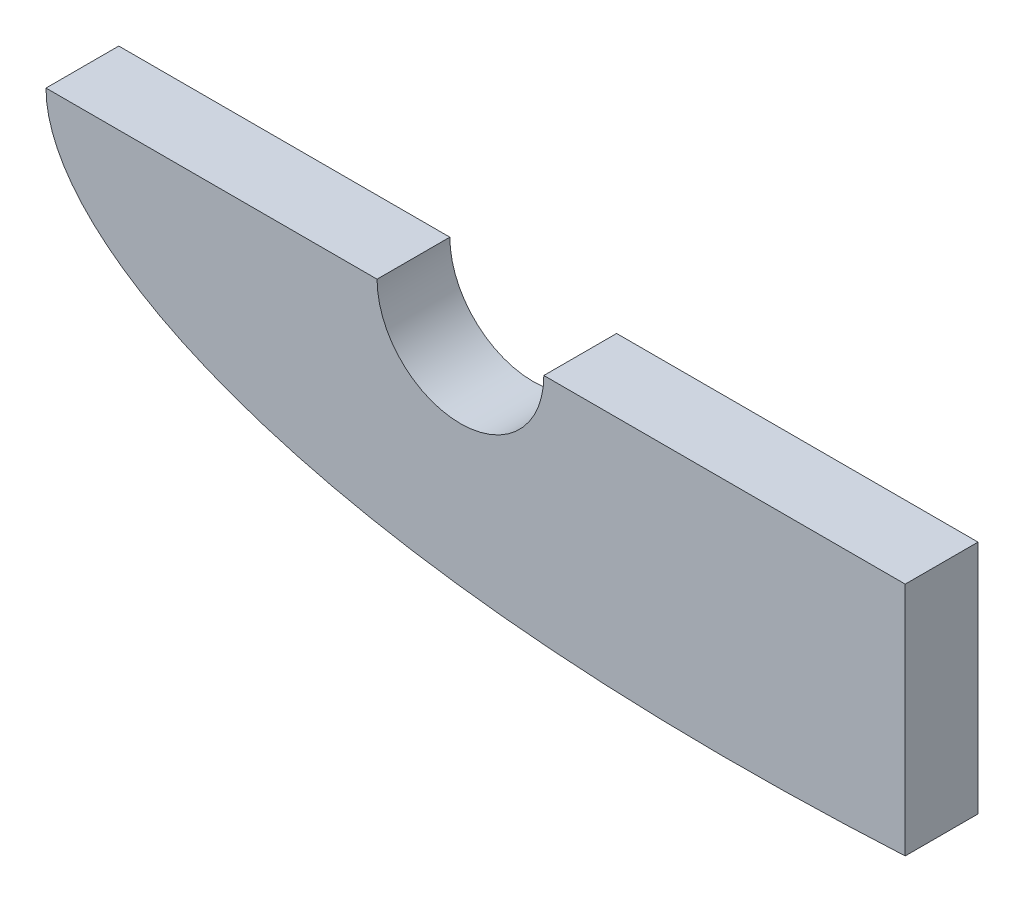
ISO-10303-21;
HEADER;
FILE_DESCRIPTION(('STEP AP214'),'2;1');
FILE_NAME('part.step','',(''),(''),'','','');
FILE_SCHEMA(('AUTOMOTIVE_DESIGN { 1 0 10303 214 1 1 1 1 }'));
ENDSEC;
DATA;
#1=APPLICATION_CONTEXT('core data for automotive mechanical design processes');
#2=APPLICATION_PROTOCOL_DEFINITION('international standard','automotive_design',2000,#1);
#3=PRODUCT_CONTEXT('',#1,'mechanical');
#4=PRODUCT('Part','Part','',(#3));
#5=PRODUCT_RELATED_PRODUCT_CATEGORY('part','',(#4));
#6=PRODUCT_DEFINITION_FORMATION('','',#4);
#7=PRODUCT_DEFINITION_CONTEXT('part definition',#1,'design');
#8=PRODUCT_DEFINITION('design','',#6,#7);
#9=PRODUCT_DEFINITION_SHAPE('','',#8);
#10=(LENGTH_UNIT() NAMED_UNIT(*) SI_UNIT(.MILLI.,.METRE.));
#11=(NAMED_UNIT(*) PLANE_ANGLE_UNIT() SI_UNIT($,.RADIAN.));
#12=(NAMED_UNIT(*) SI_UNIT($,.STERADIAN.) SOLID_ANGLE_UNIT());
#13=UNCERTAINTY_MEASURE_WITH_UNIT(LENGTH_MEASURE(1.E-05),#10,'distance_accuracy_value','');
#14=(GEOMETRIC_REPRESENTATION_CONTEXT(3) GLOBAL_UNCERTAINTY_ASSIGNED_CONTEXT((#13)) GLOBAL_UNIT_ASSIGNED_CONTEXT((#10,
#11,#12)) REPRESENTATION_CONTEXT('',''));
#15=CARTESIAN_POINT('',(0.,0.,0.));
#16=DIRECTION('',(0.,0.,1.));
#17=DIRECTION('',(1.,0.,0.));
#18=AXIS2_PLACEMENT_3D('',#15,#16,#17);
#19=CARTESIAN_POINT('',(-20.3304516756675,4.76210118540821,9.14391520155533));
#20=DIRECTION('',(0.,1.,0.));
#21=DIRECTION('',(-1.,0.,0.));
#22=AXIS2_PLACEMENT_3D('',#19,#20,#21);
#23=PLANE('',#22);
#24=DIRECTION('',(0.,0.,1.));
#25=VECTOR('',#24,1.);
#26=CARTESIAN_POINT('',(7.39896389910255,4.76210118540821,-3.04808479844465));
#27=LINE('',#26,#25);
#28=CARTESIAN_POINT('',(7.39896389910255,4.76210118540821,-3.04808479844465));
#29=VERTEX_POINT('',#28);
#30=CARTESIAN_POINT('',(7.39896389910255,4.76210118540821,3.04791520155545));
#31=VERTEX_POINT('',#30);
#32=EDGE_CURVE('E49',#29,#31,#27,.T.);
#33=ORIENTED_EDGE('',*,*,#32,.F.);
#34=DIRECTION('',(1.,0.,0.));
#35=VECTOR('',#34,1.);
#36=CARTESIAN_POINT('',(-20.3304516756673,4.76210118540821,-3.04808479844465));
#37=LINE('',#36,#35);
#38=CARTESIAN_POINT('',(-20.3293694376177,4.76210118540771,-3.04808479844465));
#39=VERTEX_POINT('',#38);
#40=EDGE_CURVE('E93',#39,#29,#37,.T.);
#41=ORIENTED_EDGE('',*,*,#40,.F.);
#42=DIRECTION('',(0.,0.,-1.));
#43=VECTOR('',#42,1.);
#44=CARTESIAN_POINT('',(-20.3293694376177,4.76210118540771,9.14391520155533));
#45=LINE('',#44,#43);
#46=CARTESIAN_POINT('',(-20.3293694376177,4.76210118540771,3.04791520155545));
#47=VERTEX_POINT('',#46);
#48=EDGE_CURVE('E43',#47,#39,#45,.T.);
#49=ORIENTED_EDGE('',*,*,#48,.F.);
#50=DIRECTION('',(1.,0.,0.));
#51=VECTOR('',#50,1.);
#52=CARTESIAN_POINT('',(-20.3304516756673,4.76210118540815,3.04791520155545));
#53=LINE('',#52,#51);
#54=EDGE_CURVE('E114',#47,#31,#53,.T.);
#55=ORIENTED_EDGE('',*,*,#54,.T.);
#56=EDGE_LOOP('',(#33,#41,#49,#55));
#57=FACE_BOUND('',#56,.T.);
#58=ADVANCED_FACE('F36',(#57),#23,.T.);
#59=CARTESIAN_POINT('',(203.190407042382,4.7621011854082,9.14391520155511));
#60=CARTESIAN_POINT('',(203.190407042382,4.76732737849093,9.14391520155511));
#61=CARTESIAN_POINT('',(201.785328341757,4.78033340308859,9.14391520155511));
#62=CARTESIAN_POINT('',(200.62072066806,4.84024364239516,9.14391520155511));
#63=CARTESIAN_POINT('',(198.505399830977,4.94328713186032,9.14391520155533));
#64=CARTESIAN_POINT('',(196.101398052739,5.10702459141593,9.14391520155533));
#65=CARTESIAN_POINT('',(193.167603611779,5.33940713424108,9.14391520155533));
#66=CARTESIAN_POINT('',(189.808359578421,5.64989546201977,9.14391520155533));
#67=CARTESIAN_POINT('',(186.008465622041,6.04518445701868,9.14391520155533));
#68=CARTESIAN_POINT('',(181.795424608179,6.53024241174227,9.14391520155555));
#69=CARTESIAN_POINT('',(177.18507388648,7.10797714189665,9.14391520155533));
#70=CARTESIAN_POINT('',(172.198922732343,7.77897688421003,9.14391520155533));
#71=CARTESIAN_POINT('',(166.858533619125,8.54173728073865,9.14391520155555));
#72=CARTESIAN_POINT('',(161.18703236106,9.39231834682447,9.14391520155555));
#73=CARTESIAN_POINT('',(155.208502910205,10.3246692071576,9.14391520155533));
#74=CARTESIAN_POINT('',(148.947991806998,11.3304651713523,9.14391520155533));
#75=CARTESIAN_POINT('',(142.431371230965,12.3993177484856,9.14391520155533));
#76=CARTESIAN_POINT('',(135.685263792449,13.5189044486457,9.14391520155533));
#77=CARTESIAN_POINT('',(128.736956272003,14.6750937497233,9.14391520155533));
#78=CARTESIAN_POINT('',(121.614353895895,15.852198135514,9.14391520155533));
#79=CARTESIAN_POINT('',(114.345934440315,17.033162429361,9.14391520155533));
#80=CARTESIAN_POINT('',(106.960724224019,18.199843366468,9.14391520155555));
#81=CARTESIAN_POINT('',(99.4882823763408,19.3332541250081,9.14391520155533));
#82=CARTESIAN_POINT('',(91.9586996575486,20.4139013525132,9.14391520155555));
#83=CARTESIAN_POINT('',(84.4025949353171,21.4220324905084,9.14391520155533));
#84=CARTESIAN_POINT('',(76.8511226164561,22.3379878441344,9.14391520155533));
#85=CARTESIAN_POINT('',(69.3359778213245,23.1424831422166,9.14391520155533));
#86=CARTESIAN_POINT('',(61.8894012268618,23.8169500734752,9.14391520155533));
#87=CARTESIAN_POINT('',(54.5441759878289,24.3438071507425,9.14391520155533));
#88=CARTESIAN_POINT('',(47.3336270991191,24.7067884741136,9.14391520155533));
#89=CARTESIAN_POINT('',(40.2916141466854,24.8912497702795,9.14391520155555));
#90=CARTESIAN_POINT('',(33.4525197892952,24.8844015044668,9.14391520155555));
#91=CARTESIAN_POINT('',(26.8512613243617,24.6753798802222,9.14391520155511));
#92=CARTESIAN_POINT('',(20.523291233981,24.2560010594353,9.14391520155511));
#93=CARTESIAN_POINT('',(14.5047002040095,23.6201836380547,9.14391520155511));
#94=CARTESIAN_POINT('',(8.83227427942734,22.7650615821516,9.14391520155533));
#95=CARTESIAN_POINT('',(3.54383871688024,21.6903349248227,9.14391520155533));
#96=CARTESIAN_POINT('',(-1.32148520395448,20.3995999030892,9.14391520155533));
#97=CARTESIAN_POINT('',(-5.72256593442688,18.9004212004412,9.14391520155533));
#98=CARTESIAN_POINT('',(-9.61549840520548,17.2061567508889,9.14391520155533));
#99=CARTESIAN_POINT('',(-12.9530076888804,15.3392423878645,9.14391520155555));
#100=CARTESIAN_POINT('',(-15.6852329071213,13.337563311922,9.14391520155533));
#101=CARTESIAN_POINT('',(-17.7661665044573,11.2664972249768,9.14391520155533));
#102=CARTESIAN_POINT('',(-19.1749918109663,9.23554818551037,9.14391520155533));
#103=CARTESIAN_POINT('',(-19.9605920638732,7.40322835585261,9.14391520155555));
#104=CARTESIAN_POINT('',(-20.277832295297,5.93336555250029,9.14391520155555));
#105=CARTESIAN_POINT('',(-20.3500866161028,4.76210118540826,9.14391520155533));
#106=CARTESIAN_POINT('',(-20.277832295297,3.59083681831601,9.14391520155533));
#107=CARTESIAN_POINT('',(-19.9605920638732,2.12097401496381,9.14391520155533));
#108=CARTESIAN_POINT('',(-19.174991810966,0.288654185305992,9.14391520155555));
#109=CARTESIAN_POINT('',(-17.7661665044573,-1.74229485416039,9.14391520155533));
#110=CARTESIAN_POINT('',(-15.6852329071213,-3.81336094110563,9.14391520155533));
#111=CARTESIAN_POINT('',(-12.9530076888804,-5.81504001704819,9.14391520155555));
#112=CARTESIAN_POINT('',(-9.61549840520548,-7.68195438007252,9.14391520155533));
#113=CARTESIAN_POINT('',(-5.72256593442688,-9.37621882962486,9.14391520155533));
#114=CARTESIAN_POINT('',(-1.32148520395448,-10.8753975322727,9.14391520155533));
#115=CARTESIAN_POINT('',(3.54383871688002,-12.1661325540064,9.14391520155533));
#116=CARTESIAN_POINT('',(8.83227427942757,-13.2408592113352,9.14391520155511));
#117=CARTESIAN_POINT('',(14.5047002040095,-14.0959812672383,9.14391520155533));
#118=CARTESIAN_POINT('',(20.523291233981,-14.7317986886189,9.14391520155533));
#119=CARTESIAN_POINT('',(26.8512613243617,-15.1511775094058,9.14391520155511));
#120=CARTESIAN_POINT('',(33.4525197892952,-15.3601991336504,9.14391520155511));
#121=CARTESIAN_POINT('',(40.2916141466854,-15.3670473994631,9.14391520155555));
#122=CARTESIAN_POINT('',(47.3336270991191,-15.1825861032972,9.14391520155533));
#123=CARTESIAN_POINT('',(54.5441759878287,-14.8196047799262,9.14391520155533));
#124=CARTESIAN_POINT('',(61.8894012268618,-14.2927477026589,9.14391520155533));
#125=CARTESIAN_POINT('',(69.3359778213247,-13.6182807714003,9.14391520155533));
#126=CARTESIAN_POINT('',(76.8511226164561,-12.813785473318,9.14391520155511));
#127=CARTESIAN_POINT('',(84.4025949353171,-11.897830119692,9.14391520155511));
#128=CARTESIAN_POINT('',(91.9586996575486,-10.8896989816968,9.14391520155511));
#129=CARTESIAN_POINT('',(99.4882823763405,-9.80905175419178,9.14391520155555));
#130=CARTESIAN_POINT('',(106.960724224019,-8.6756409956516,9.14391520155555));
#131=CARTESIAN_POINT('',(114.345934440315,-7.50896005854462,9.14391520155555));
#132=CARTESIAN_POINT('',(121.614353895895,-6.32799576469761,9.14391520155533));
#133=CARTESIAN_POINT('',(128.736956272003,-5.1508913789069,9.14391520155533));
#134=CARTESIAN_POINT('',(135.68526379245,-3.99470207782932,9.14391520155533));
#135=CARTESIAN_POINT('',(142.431371230966,-2.87511537766927,9.14391520155533));
#136=CARTESIAN_POINT('',(148.947991806998,-1.80626280053592,9.14391520155533));
#137=CARTESIAN_POINT('',(155.208502910206,-0.800466836341218,9.14391520155533));
#138=CARTESIAN_POINT('',(161.18703236106,0.131884023991891,9.14391520155555));
#139=CARTESIAN_POINT('',(166.858533619125,0.982465090077767,9.14391520155533));
#140=CARTESIAN_POINT('',(172.198922732343,1.74522548660638,9.14391520155533));
#141=CARTESIAN_POINT('',(177.18507388648,2.41622522891971,9.14391520155533));
#142=CARTESIAN_POINT('',(181.795424608179,2.99395995907414,9.14391520155533));
#143=CARTESIAN_POINT('',(186.008465622041,3.47901791379768,9.14391520155533));
#144=CARTESIAN_POINT('',(189.808359578421,3.87430690879659,9.14391520155533));
#145=CARTESIAN_POINT('',(193.167603611779,4.18479523657528,9.14391520155533));
#146=CARTESIAN_POINT('',(196.101398052738,4.41717777940043,9.14391520155533));
#147=CARTESIAN_POINT('',(198.505399830977,4.5809152389561,9.14391520155533));
#148=CARTESIAN_POINT('',(200.62072066806,4.6839587284212,9.14391520155511));
#149=CARTESIAN_POINT('',(201.785328341757,4.74386896772777,9.14391520155511));
#150=CARTESIAN_POINT('',(203.190407042382,4.75687499232547,9.14391520155511));
#151=CARTESIAN_POINT('',(203.190407042382,4.7621011854082,9.14391520155511));
#152=B_SPLINE_CURVE_WITH_KNOTS('',3,(#59,#60,#61,#62,#63,#64,#65,#66,#67,#68,#69,#70,#71,#72,
#73,#74,#75,#76,#77,#78,#79,#80,#81,#82,#83,#84,#85,#86,#87,#88,#89,#90,#91,#92,#93,#94,#95,#96,
#97,#98,#99,#100,#101,#102,#103,#104,#105,#106,#107,#108,#109,#110,#111,#112,#113,#114,#115,
#116,#117,#118,#119,#120,#121,#122,#123,#124,#125,#126,#127,#128,#129,#130,#131,#132,#133,#134,
#135,#136,#137,#138,#139,#140,#141,#142,#143,#144,#145,#146,#147,#148,#149,#150,#151),
.UNSPECIFIED.,.T.,.F.,(4,1,1,1,1,1,1,1,1,1,1,1,1,1,1,1,1,1,1,1,1,1,1,1,1,1,1,1,1,1,1,1,1,1,1,1,
1,1,1,1,1,1,1,1,1,1,1,1,1,1,1,1,1,1,1,1,1,1,1,1,1,1,1,1,1,1,1,1,1,1,1,1,1,1,1,1,1,1,1,1,1,1,1,1,
1,1,1,1,1,1,4),(0.,0.00216777795588342,0.00539478220000884,0.00966720698444134,
0.0149667883303173,0.0212708876900959,0.0285525550130683,0.0367806836725549,0.0459201019032637,
0.0559317636633187,0.0667728836144854,0.0783971303496518,0.0907548266908363,0.103793164577546,
0.117456431914319,0.131686225652521,0.146421738497113,0.161599998000845,0.177156132626574,
0.193023668070302,0.209134785631037,0.225420632511523,0.241811601924249,0.258237646860869,
0.274628556698349,0.290914287398014,0.307025228908797,0.322892517177238,0.33844834182358,
0.353626206573582,0.368361231970712,0.382590427827798,0.396252960572084,0.40929041186716,
0.421647009590256,0.433269881487031,0.444109248914041,0.454118639688981,0.463255054987312,
0.471479113777303,0.478755288570903,0.485052318112802,0.490344025694165,0.494609832614287,
0.497833231437255,0.5,0.502166768562745,0.505390167385713,0.509655974305835,0.514947681887198,
0.521244711429097,0.528520886222697,0.536744945012688,0.545881360311019,0.555890751085959,
0.566730118512969,0.578352990409744,0.59070958813284,0.603747039427916,0.617409572172202,
0.631638768029288,0.646373793426418,0.66155165817642,0.677107482822761,0.692974771091203,
0.709085712601986,0.725371443301651,0.741762353139131,0.758188398075751,0.774579367488477,
0.790865214368963,0.806976331929698,0.822843867373426,0.838400001999155,0.853578261502887,
0.868313774347479,0.882543568085681,0.896206835422454,0.909245173309164,0.921602869650348,
0.933227116385514,0.944068236336681,0.954079898096736,0.963219316327445,0.971447444986932,
0.978729112309904,0.985033211669683,0.990332793015559,0.994605217799991,0.997832222044117,1.),.UNSPECIFIED.);
#153=DIRECTION('',(0.,0.,-1.));
#154=VECTOR('',#153,1.);
#155=SURFACE_OF_LINEAR_EXTRUSION('',#152,#154);
#156=CARTESIAN_POINT('',(203.190407042382,4.76210118540811,3.04791520155523));
#157=CARTESIAN_POINT('',(203.190407042382,4.76732737849083,3.04791520155523));
#158=CARTESIAN_POINT('',(201.785328341758,4.78033340308853,3.04791520155523));
#159=CARTESIAN_POINT('',(200.620720668061,4.84024364239516,3.04791520155523));
#160=CARTESIAN_POINT('',(198.505399830977,4.94328713186021,3.04791520155523));
#161=CARTESIAN_POINT('',(196.101398052739,5.10702459141593,3.04791520155523));
#162=CARTESIAN_POINT('',(193.167603611779,5.33940713424102,3.04791520155523));
#163=CARTESIAN_POINT('',(189.808359578422,5.64989546201972,3.04791520155545));
#164=CARTESIAN_POINT('',(186.008465622042,6.04518445701868,3.04791520155545));
#165=CARTESIAN_POINT('',(181.795424608179,6.53024241174227,3.04791520155545));
#166=CARTESIAN_POINT('',(177.18507388648,7.10797714189665,3.04791520155523));
#167=CARTESIAN_POINT('',(172.198922732344,7.77897688420998,3.04791520155545));
#168=CARTESIAN_POINT('',(166.858533619125,8.54173728073859,3.04791520155545));
#169=CARTESIAN_POINT('',(161.18703236106,9.39231834682447,3.04791520155545));
#170=CARTESIAN_POINT('',(155.208502910205,10.3246692071576,3.04791520155545));
#171=CARTESIAN_POINT('',(148.947991806998,11.3304651713523,3.04791520155523));
#172=CARTESIAN_POINT('',(142.431371230966,12.3993177484856,3.04791520155545));
#173=CARTESIAN_POINT('',(135.68526379245,13.5189044486456,3.04791520155523));
#174=CARTESIAN_POINT('',(128.736956272003,14.6750937497233,3.04791520155545));
#175=CARTESIAN_POINT('',(121.614353895895,15.8521981355139,3.04791520155523));
#176=CARTESIAN_POINT('',(114.345934440315,17.033162429361,3.04791520155545));
#177=CARTESIAN_POINT('',(106.96072422402,18.1998433664679,3.04791520155545));
#178=CARTESIAN_POINT('',(99.4882823763408,19.3332541250081,3.04791520155545));
#179=CARTESIAN_POINT('',(91.9586996575488,20.4139013525131,3.04791520155545));
#180=CARTESIAN_POINT('',(84.4025949353173,21.4220324905084,3.04791520155545));
#181=CARTESIAN_POINT('',(76.8511226164561,22.3379878441344,3.04791520155523));
#182=CARTESIAN_POINT('',(69.3359778213247,23.1424831422166,3.04791520155523));
#183=CARTESIAN_POINT('',(61.889401226862,23.8169500734752,3.04791520155545));
#184=CARTESIAN_POINT('',(54.5441759878291,24.3438071507425,3.04791520155523));
#185=CARTESIAN_POINT('',(47.3336270991194,24.7067884741136,3.04791520155545));
#186=CARTESIAN_POINT('',(40.2916141466856,24.8912497702794,3.04791520155545));
#187=CARTESIAN_POINT('',(33.4525197892954,24.8844015044668,3.04791520155545));
#188=CARTESIAN_POINT('',(26.8512613243617,24.6753798802221,3.04791520155523));
#189=CARTESIAN_POINT('',(20.5232912339812,24.2560010594353,3.04791520155523));
#190=CARTESIAN_POINT('',(14.5047002040097,23.6201836380547,3.04791520155523));
#191=CARTESIAN_POINT('',(8.83227427942757,22.7650615821516,3.04791520155523));
#192=CARTESIAN_POINT('',(3.54383871688047,21.6903349248227,3.04791520155523));
#193=CARTESIAN_POINT('',(-1.32148520395425,20.3995999030892,3.04791520155523));
#194=CARTESIAN_POINT('',(-5.72256593442666,18.9004212004412,3.04791520155523));
#195=CARTESIAN_POINT('',(-9.61549840520526,17.2061567508889,3.04791520155523));
#196=CARTESIAN_POINT('',(-12.9530076888804,15.3392423878645,3.04791520155545));
#197=CARTESIAN_POINT('',(-15.6852329071213,13.3375633119219,3.04791520155545));
#198=CARTESIAN_POINT('',(-17.7661665044571,11.2664972249768,3.04791520155545));
#199=CARTESIAN_POINT('',(-19.174991810966,9.23554818551037,3.04791520155523));
#200=CARTESIAN_POINT('',(-19.960592063873,7.40322835585261,3.04791520155545));
#201=CARTESIAN_POINT('',(-20.277832295297,5.93336555250024,3.04791520155545));
#202=CARTESIAN_POINT('',(-20.3500866161028,4.76210118540826,3.04791520155545));
#203=CARTESIAN_POINT('',(-20.277832295297,3.59083681831601,3.04791520155545));
#204=CARTESIAN_POINT('',(-19.960592063873,2.12097401496375,3.04791520155523));
#205=CARTESIAN_POINT('',(-19.1749918109658,0.288654185305992,3.04791520155545));
#206=CARTESIAN_POINT('',(-17.7661665044571,-1.74229485416044,3.04791520155545));
#207=CARTESIAN_POINT('',(-15.6852329071211,-3.81336094110568,3.04791520155523));
#208=CARTESIAN_POINT('',(-12.9530076888802,-5.81504001704825,3.04791520155545));
#209=CARTESIAN_POINT('',(-9.61549840520548,-7.68195438007252,3.04791520155545));
#210=CARTESIAN_POINT('',(-5.72256593442666,-9.37621882962492,3.04791520155523));
#211=CARTESIAN_POINT('',(-1.32148520395425,-10.8753975322728,3.04791520155545));
#212=CARTESIAN_POINT('',(3.54383871688024,-12.1661325540064,3.04791520155523));
#213=CARTESIAN_POINT('',(8.83227427942779,-13.2408592113352,3.04791520155523));
#214=CARTESIAN_POINT('',(14.5047002040097,-14.0959812672383,3.04791520155545));
#215=CARTESIAN_POINT('',(20.5232912339812,-14.731798688619,3.04791520155523));
#216=CARTESIAN_POINT('',(26.8512613243617,-15.1511775094058,3.04791520155523));
#217=CARTESIAN_POINT('',(33.4525197892952,-15.3601991336504,3.04791520155523));
#218=CARTESIAN_POINT('',(40.2916141466856,-15.3670473994632,3.04791520155545));
#219=CARTESIAN_POINT('',(47.3336270991194,-15.1825861032972,3.04791520155545));
#220=CARTESIAN_POINT('',(54.5441759878289,-14.8196047799262,3.04791520155545));
#221=CARTESIAN_POINT('',(61.8894012268618,-14.2927477026589,3.04791520155523));
#222=CARTESIAN_POINT('',(69.3359778213249,-13.6182807714003,3.04791520155523));
#223=CARTESIAN_POINT('',(76.8511226164563,-12.8137854733181,3.04791520155523));
#224=CARTESIAN_POINT('',(84.4025949353173,-11.897830119692,3.04791520155523));
#225=CARTESIAN_POINT('',(91.9586996575488,-10.8896989816968,3.04791520155523));
#226=CARTESIAN_POINT('',(99.4882823763408,-9.80905175419178,3.04791520155545));
#227=CARTESIAN_POINT('',(106.960724224019,-8.67564099565166,3.04791520155545));
#228=CARTESIAN_POINT('',(114.345934440315,-7.50896005854468,3.04791520155545));
#229=CARTESIAN_POINT('',(121.614353895895,-6.32799576469761,3.04791520155545));
#230=CARTESIAN_POINT('',(128.736956272003,-5.15089137890695,3.04791520155545));
#231=CARTESIAN_POINT('',(135.68526379245,-3.99470207782932,3.04791520155545));
#232=CARTESIAN_POINT('',(142.431371230966,-2.87511537766932,3.04791520155523));
#233=CARTESIAN_POINT('',(148.947991806998,-1.80626280053597,3.04791520155523));
#234=CARTESIAN_POINT('',(155.208502910206,-0.800466836341274,3.04791520155523));
#235=CARTESIAN_POINT('',(161.18703236106,0.131884023991891,3.04791520155545));
#236=CARTESIAN_POINT('',(166.858533619125,0.982465090077711,3.04791520155545));
#237=CARTESIAN_POINT('',(172.198922732344,1.74522548660633,3.04791520155545));
#238=CARTESIAN_POINT('',(177.18507388648,2.41622522891966,3.04791520155545));
#239=CARTESIAN_POINT('',(181.795424608179,2.99395995907403,3.04791520155545));
#240=CARTESIAN_POINT('',(186.008465622042,3.47901791379768,3.04791520155523));
#241=CARTESIAN_POINT('',(189.808359578422,3.87430690879653,3.04791520155523));
#242=CARTESIAN_POINT('',(193.167603611779,4.18479523657528,3.04791520155523));
#243=CARTESIAN_POINT('',(196.101398052738,4.41717777940037,3.04791520155523));
#244=CARTESIAN_POINT('',(198.505399830978,4.5809152389561,3.04791520155523));
#245=CARTESIAN_POINT('',(200.62072066806,4.68395872842114,3.04791520155523));
#246=CARTESIAN_POINT('',(201.785328341757,4.74386896772777,3.04791520155523));
#247=CARTESIAN_POINT('',(203.190407042382,4.75687499232539,3.04791520155523));
#248=CARTESIAN_POINT('',(203.190407042382,4.76210118540811,3.04791520155523));
#249=B_SPLINE_CURVE_WITH_KNOTS('',3,(#156,#157,#158,#159,#160,#161,#162,#163,#164,#165,#166,
#167,#168,#169,#170,#171,#172,#173,#174,#175,#176,#177,#178,#179,#180,#181,#182,#183,#184,#185,
#186,#187,#188,#189,#190,#191,#192,#193,#194,#195,#196,#197,#198,#199,#200,#201,#202,#203,#204,
#205,#206,#207,#208,#209,#210,#211,#212,#213,#214,#215,#216,#217,#218,#219,#220,#221,#222,#223,
#224,#225,#226,#227,#228,#229,#230,#231,#232,#233,#234,#235,#236,#237,#238,#239,#240,#241,#242,
#243,#244,#245,#246,#247,#248),.UNSPECIFIED.,.T.,.F.,(4,1,1,1,1,1,1,1,1,1,1,1,1,1,1,1,1,1,1,1,1,
1,1,1,1,1,1,1,1,1,1,1,1,1,1,1,1,1,1,1,1,1,1,1,1,1,1,1,1,1,1,1,1,1,1,1,1,1,1,1,1,1,1,1,1,1,1,1,1,
1,1,1,1,1,1,1,1,1,1,1,1,1,1,1,1,1,1,1,1,1,4),(0.,0.00216777795588342,0.00539478220000884,
0.00966720698444134,0.0149667883303173,0.0212708876900959,0.0285525550130683,0.0367806836725549,
0.0459201019032637,0.0559317636633187,0.0667728836144854,0.0783971303496518,0.0907548266908363,
0.103793164577546,0.117456431914319,0.131686225652521,0.146421738497113,0.161599998000845,
0.177156132626574,0.193023668070302,0.209134785631037,0.225420632511523,0.241811601924249,
0.258237646860869,0.274628556698349,0.290914287398014,0.307025228908797,0.322892517177238,
0.33844834182358,0.353626206573582,0.368361231970712,0.382590427827798,0.396252960572084,
0.40929041186716,0.421647009590256,0.433269881487031,0.444109248914041,0.454118639688981,
0.463255054987312,0.471479113777303,0.478755288570903,0.485052318112802,0.490344025694165,
0.494609832614287,0.497833231437255,0.5,0.502166768562745,0.505390167385713,0.509655974305835,
0.514947681887198,0.521244711429097,0.528520886222697,0.536744945012688,0.545881360311019,
0.555890751085959,0.566730118512969,0.578352990409744,0.59070958813284,0.603747039427916,
0.617409572172202,0.631638768029288,0.646373793426418,0.66155165817642,0.677107482822761,
0.692974771091203,0.709085712601986,0.725371443301651,0.741762353139131,0.758188398075751,
0.774579367488477,0.790865214368963,0.806976331929698,0.822843867373426,0.838400001999155,
0.853578261502887,0.868313774347479,0.882543568085681,0.896206835422454,0.909245173309164,
0.921602869650348,0.933227116385514,0.944068236336681,0.954079898096736,0.963219316327445,
0.971447444986932,0.978729112309904,0.985033211669683,0.990332793015559,0.994605217799991,
0.997832222044117,1.),.UNSPECIFIED.);
#250=CARTESIAN_POINT('',(51.6372972290491,-14.9584992220643,3.04791520155545));
#251=VERTEX_POINT('',#250);
#252=EDGE_CURVE('E109',#47,#251,#249,.T.);
#253=ORIENTED_EDGE('',*,*,#252,.F.);
#254=ORIENTED_EDGE('',*,*,#48,.T.);
#255=CARTESIAN_POINT('',(203.190407042382,4.76210118540816,-3.04808479844487));
#256=CARTESIAN_POINT('',(203.190407042382,4.76732737849089,-3.04808479844487));
#257=CARTESIAN_POINT('',(201.785328341757,4.78033340308859,-3.04808479844487));
#258=CARTESIAN_POINT('',(200.62072066806,4.84024364239516,-3.04808479844487));
#259=CARTESIAN_POINT('',(198.505399830977,4.94328713186026,-3.04808479844465));
#260=CARTESIAN_POINT('',(196.101398052739,5.10702459141599,-3.04808479844465));
#261=CARTESIAN_POINT('',(193.167603611779,5.33940713424108,-3.04808479844465));
#262=CARTESIAN_POINT('',(189.808359578421,5.64989546201977,-3.04808479844465));
#263=CARTESIAN_POINT('',(186.008465622042,6.04518445701874,-3.04808479844465));
#264=CARTESIAN_POINT('',(181.795424608179,6.53024241174227,-3.04808479844465));
#265=CARTESIAN_POINT('',(177.18507388648,7.10797714189665,-3.04808479844465));
#266=CARTESIAN_POINT('',(172.198922732344,7.77897688421003,-3.04808479844465));
#267=CARTESIAN_POINT('',(166.858533619125,8.54173728073865,-3.04808479844465));
#268=CARTESIAN_POINT('',(161.18703236106,9.39231834682447,-3.04808479844443));
#269=CARTESIAN_POINT('',(155.208502910205,10.3246692071576,-3.04808479844465));
#270=CARTESIAN_POINT('',(148.947991806998,11.3304651713523,-3.04808479844465));
#271=CARTESIAN_POINT('',(142.431371230966,12.3993177484856,-3.04808479844465));
#272=CARTESIAN_POINT('',(135.68526379245,13.5189044486457,-3.04808479844465));
#273=CARTESIAN_POINT('',(128.736956272003,14.6750937497233,-3.04808479844465));
#274=CARTESIAN_POINT('',(121.614353895895,15.8521981355139,-3.04808479844465));
#275=CARTESIAN_POINT('',(114.345934440315,17.033162429361,-3.04808479844465));
#276=CARTESIAN_POINT('',(106.96072422402,18.199843366468,-3.04808479844465));
#277=CARTESIAN_POINT('',(99.4882823763405,19.3332541250081,-3.04808479844465));
#278=CARTESIAN_POINT('',(91.9586996575488,20.4139013525132,-3.04808479844465));
#279=CARTESIAN_POINT('',(84.4025949353171,21.4220324905084,-3.04808479844465));
#280=CARTESIAN_POINT('',(76.8511226164561,22.3379878441344,-3.04808479844487));
#281=CARTESIAN_POINT('',(69.3359778213247,23.1424831422166,-3.04808479844465));
#282=CARTESIAN_POINT('',(61.8894012268618,23.8169500734752,-3.04808479844465));
#283=CARTESIAN_POINT('',(54.5441759878289,24.3438071507425,-3.04808479844465));
#284=CARTESIAN_POINT('',(47.3336270991194,24.7067884741136,-3.04808479844465));
#285=CARTESIAN_POINT('',(40.2916141466854,24.8912497702795,-3.04808479844465));
#286=CARTESIAN_POINT('',(33.4525197892954,24.8844015044669,-3.04808479844443));
#287=CARTESIAN_POINT('',(26.8512613243617,24.6753798802222,-3.04808479844487));
#288=CARTESIAN_POINT('',(20.5232912339812,24.2560010594353,-3.04808479844487));
#289=CARTESIAN_POINT('',(14.5047002040097,23.6201836380547,-3.04808479844487));
#290=CARTESIAN_POINT('',(8.83227427942757,22.7650615821516,-3.04808479844465));
#291=CARTESIAN_POINT('',(3.54383871688024,21.6903349248228,-3.04808479844465));
#292=CARTESIAN_POINT('',(-1.32148520395425,20.3995999030892,-3.04808479844465));
#293=CARTESIAN_POINT('',(-5.72256593442666,18.9004212004412,-3.04808479844465));
#294=CARTESIAN_POINT('',(-9.61549840520526,17.2061567508889,-3.04808479844465));
#295=CARTESIAN_POINT('',(-12.9530076888804,15.3392423878645,-3.04808479844465));
#296=CARTESIAN_POINT('',(-15.6852329071213,13.337563311922,-3.04808479844465));
#297=CARTESIAN_POINT('',(-17.7661665044571,11.2664972249768,-3.04808479844465));
#298=CARTESIAN_POINT('',(-19.174991810966,9.23554818551037,-3.04808479844465));
#299=CARTESIAN_POINT('',(-19.960592063873,7.40322835585261,-3.04808479844443));
#300=CARTESIAN_POINT('',(-20.277832295297,5.93336555250029,-3.04808479844465));
#301=CARTESIAN_POINT('',(-20.3500866161028,4.76210118540826,-3.04808479844465));
#302=CARTESIAN_POINT('',(-20.277832295297,3.59083681831601,-3.04808479844465));
#303=CARTESIAN_POINT('',(-19.960592063873,2.12097401496381,-3.04808479844465));
#304=CARTESIAN_POINT('',(-19.174991810966,0.288654185306048,-3.04808479844443));
#305=CARTESIAN_POINT('',(-17.7661665044571,-1.74229485416039,-3.04808479844465));
#306=CARTESIAN_POINT('',(-15.6852329071211,-3.81336094110563,-3.04808479844465));
#307=CARTESIAN_POINT('',(-12.9530076888802,-5.81504001704819,-3.04808479844465));
#308=CARTESIAN_POINT('',(-9.61549840520548,-7.68195438007246,-3.04808479844465));
#309=CARTESIAN_POINT('',(-5.72256593442666,-9.37621882962486,-3.04808479844465));
#310=CARTESIAN_POINT('',(-1.32148520395425,-10.8753975322727,-3.04808479844465));
#311=CARTESIAN_POINT('',(3.54383871688024,-12.1661325540064,-3.04808479844465));
#312=CARTESIAN_POINT('',(8.83227427942779,-13.2408592113352,-3.04808479844487));
#313=CARTESIAN_POINT('',(14.5047002040097,-14.0959812672383,-3.04808479844465));
#314=CARTESIAN_POINT('',(20.5232912339812,-14.7317986886189,-3.04808479844465));
#315=CARTESIAN_POINT('',(26.8512613243617,-15.1511775094058,-3.04808479844487));
#316=CARTESIAN_POINT('',(33.4525197892952,-15.3601991336504,-3.04808479844487));
#317=CARTESIAN_POINT('',(40.2916141466854,-15.3670473994631,-3.04808479844443));
#318=CARTESIAN_POINT('',(47.3336270991194,-15.1825861032972,-3.04808479844465));
#319=CARTESIAN_POINT('',(54.5441759878289,-14.8196047799262,-3.04808479844465));
#320=CARTESIAN_POINT('',(61.8894012268618,-14.2927477026589,-3.04808479844465));
#321=CARTESIAN_POINT('',(69.3359778213247,-13.6182807714003,-3.04808479844465));
#322=CARTESIAN_POINT('',(76.8511226164563,-12.813785473318,-3.04808479844487));
#323=CARTESIAN_POINT('',(84.4025949353173,-11.897830119692,-3.04808479844487));
#324=CARTESIAN_POINT('',(91.9586996575488,-10.8896989816968,-3.04808479844487));
#325=CARTESIAN_POINT('',(99.4882823763405,-9.80905175419178,-3.04808479844443));
#326=CARTESIAN_POINT('',(106.960724224019,-8.6756409956516,-3.04808479844443));
#327=CARTESIAN_POINT('',(114.345934440315,-7.50896005854462,-3.04808479844465));
#328=CARTESIAN_POINT('',(121.614353895895,-6.32799576469756,-3.04808479844465));
#329=CARTESIAN_POINT('',(128.736956272003,-5.1508913789069,-3.04808479844465));
#330=CARTESIAN_POINT('',(135.68526379245,-3.99470207782932,-3.04808479844465));
#331=CARTESIAN_POINT('',(142.431371230966,-2.87511537766927,-3.04808479844465));
#332=CARTESIAN_POINT('',(148.947991806998,-1.80626280053592,-3.04808479844465));
#333=CARTESIAN_POINT('',(155.208502910206,-0.800466836341218,-3.04808479844465));
#334=CARTESIAN_POINT('',(161.18703236106,0.131884023991946,-3.04808479844465));
#335=CARTESIAN_POINT('',(166.858533619125,0.982465090077711,-3.04808479844465));
#336=CARTESIAN_POINT('',(172.198922732344,1.74522548660638,-3.04808479844465));
#337=CARTESIAN_POINT('',(177.18507388648,2.41622522891971,-3.04808479844465));
#338=CARTESIAN_POINT('',(181.795424608179,2.99395995907409,-3.04808479844465));
#339=CARTESIAN_POINT('',(186.008465622042,3.47901791379773,-3.04808479844465));
#340=CARTESIAN_POINT('',(189.808359578422,3.87430690879659,-3.04808479844465));
#341=CARTESIAN_POINT('',(193.167603611779,4.18479523657528,-3.04808479844465));
#342=CARTESIAN_POINT('',(196.101398052738,4.41717777940037,-3.04808479844465));
#343=CARTESIAN_POINT('',(198.505399830977,4.5809152389561,-3.04808479844487));
#344=CARTESIAN_POINT('',(200.62072066806,4.6839587284212,-3.04808479844487));
#345=CARTESIAN_POINT('',(201.785328341757,4.74386896772777,-3.04808479844487));
#346=CARTESIAN_POINT('',(203.190407042382,4.75687499232543,-3.04808479844487));
#347=CARTESIAN_POINT('',(203.190407042382,4.76210118540816,-3.04808479844487));
#348=B_SPLINE_CURVE_WITH_KNOTS('',3,(#255,#256,#257,#258,#259,#260,#261,#262,#263,#264,#265,
#266,#267,#268,#269,#270,#271,#272,#273,#274,#275,#276,#277,#278,#279,#280,#281,#282,#283,#284,
#285,#286,#287,#288,#289,#290,#291,#292,#293,#294,#295,#296,#297,#298,#299,#300,#301,#302,#303,
#304,#305,#306,#307,#308,#309,#310,#311,#312,#313,#314,#315,#316,#317,#318,#319,#320,#321,#322,
#323,#324,#325,#326,#327,#328,#329,#330,#331,#332,#333,#334,#335,#336,#337,#338,#339,#340,#341,
#342,#343,#344,#345,#346,#347),.UNSPECIFIED.,.T.,.F.,(4,1,1,1,1,1,1,1,1,1,1,1,1,1,1,1,1,1,1,1,1,
1,1,1,1,1,1,1,1,1,1,1,1,1,1,1,1,1,1,1,1,1,1,1,1,1,1,1,1,1,1,1,1,1,1,1,1,1,1,1,1,1,1,1,1,1,1,1,1,
1,1,1,1,1,1,1,1,1,1,1,1,1,1,1,1,1,1,1,1,1,4),(0.,0.00216777795588342,0.00539478220000884,
0.00966720698444134,0.0149667883303173,0.0212708876900959,0.0285525550130683,0.0367806836725549,
0.0459201019032637,0.0559317636633187,0.0667728836144854,0.0783971303496518,0.0907548266908363,
0.103793164577546,0.117456431914319,0.131686225652521,0.146421738497113,0.161599998000845,
0.177156132626574,0.193023668070302,0.209134785631037,0.225420632511523,0.241811601924249,
0.258237646860869,0.274628556698349,0.290914287398014,0.307025228908797,0.322892517177238,
0.33844834182358,0.353626206573582,0.368361231970712,0.382590427827798,0.396252960572084,
0.40929041186716,0.421647009590256,0.433269881487031,0.444109248914041,0.454118639688981,
0.463255054987312,0.471479113777303,0.478755288570903,0.485052318112802,0.490344025694165,
0.494609832614287,0.497833231437255,0.5,0.502166768562745,0.505390167385713,0.509655974305835,
0.514947681887198,0.521244711429097,0.528520886222697,0.536744945012688,0.545881360311019,
0.555890751085959,0.566730118512969,0.578352990409744,0.59070958813284,0.603747039427916,
0.617409572172202,0.631638768029288,0.646373793426418,0.66155165817642,0.677107482822761,
0.692974771091203,0.709085712601986,0.725371443301651,0.741762353139131,0.758188398075751,
0.774579367488477,0.790865214368963,0.806976331929698,0.822843867373426,0.838400001999155,
0.853578261502887,0.868313774347479,0.882543568085681,0.896206835422454,0.909245173309164,
0.921602869650348,0.933227116385514,0.944068236336681,0.954079898096736,0.963219316327445,
0.971447444986932,0.978729112309904,0.985033211669683,0.990332793015559,0.994605217799991,
0.997832222044117,1.),.UNSPECIFIED.);
#349=CARTESIAN_POINT('',(51.6372972460855,-14.9584992220643,-3.04808479844465));
#350=VERTEX_POINT('',#349);
#351=EDGE_CURVE('E100',#39,#350,#348,.T.);
#352=ORIENTED_EDGE('',*,*,#351,.T.);
#353=DIRECTION('',(0.,0.,-1.));
#354=VECTOR('',#353,1.);
#355=CARTESIAN_POINT('',(51.6372972290489,-14.958499222955,9.14391520155533));
#356=LINE('',#355,#354);
#357=EDGE_CURVE('E112',#350,#251,#356,.F.);
#358=ORIENTED_EDGE('',*,*,#357,.T.);
#359=EDGE_LOOP('',(#253,#254,#352,#358));
#360=FACE_BOUND('',#359,.T.);
#361=ADVANCED_FACE('F107',(#360),#155,.F.);
#362=CARTESIAN_POINT('',(51.6372972290489,4.57065761093312,9.14391520155533));
#363=DIRECTION('',(1.,0.,0.));
#364=DIRECTION('',(0.,0.,-1.));
#365=AXIS2_PLACEMENT_3D('',#362,#363,#364);
#366=PLANE('',#365);
#367=DIRECTION('',(0.,0.,-1.));
#368=VECTOR('',#367,1.);
#369=CARTESIAN_POINT('',(51.6372972290489,4.76210118540821,9.14391520155533));
#370=LINE('',#369,#368);
#371=CARTESIAN_POINT('',(51.6372972290491,4.76210118540821,3.04791520155545));
#372=VERTEX_POINT('',#371);
#373=CARTESIAN_POINT('',(51.6372972290491,4.76210118540821,-3.04808479844465));
#374=VERTEX_POINT('',#373);
#375=EDGE_CURVE('E97',#372,#374,#370,.T.);
#376=ORIENTED_EDGE('',*,*,#375,.F.);
#377=DIRECTION('',(0.,-1.,0.));
#378=VECTOR('',#377,1.);
#379=CARTESIAN_POINT('',(51.6372972290491,4.57065761093312,3.04791520155545));
#380=LINE('',#379,#378);
#381=EDGE_CURVE('E184',#372,#251,#380,.T.);
#382=ORIENTED_EDGE('',*,*,#381,.T.);
#383=ORIENTED_EDGE('',*,*,#357,.F.);
#384=DIRECTION('',(0.,-1.,0.));
#385=VECTOR('',#384,1.);
#386=CARTESIAN_POINT('',(51.6372972290489,4.57065761093317,-3.04808479844465));
#387=LINE('',#386,#385);
#388=EDGE_CURVE('E57',#374,#350,#387,.T.);
#389=ORIENTED_EDGE('',*,*,#388,.F.);
#390=EDGE_LOOP('',(#376,#382,#383,#389));
#391=FACE_BOUND('',#390,.T.);
#392=ADVANCED_FACE('F131',(#391),#366,.T.);
#393=CARTESIAN_POINT('',(-20.3304516756675,4.76210118540821,9.14391520155533));
#394=DIRECTION('',(0.,1.,0.));
#395=DIRECTION('',(-1.,0.,0.));
#396=AXIS2_PLACEMENT_3D('',#393,#394,#395);
#397=PLANE('',#396);
#398=DIRECTION('',(0.,0.,1.));
#399=VECTOR('',#398,1.);
#400=CARTESIAN_POINT('',(21.3689638991021,4.76210118540815,-3.04808479844487));
#401=LINE('',#400,#399);
#402=CARTESIAN_POINT('',(21.3689638991024,4.76210118540815,3.04791520155523));
#403=VERTEX_POINT('',#402);
#404=CARTESIAN_POINT('',(21.3689638991021,4.76210118540815,-3.04808479844487));
#405=VERTEX_POINT('',#404);
#406=EDGE_CURVE('E80',#403,#405,#401,.F.);
#407=ORIENTED_EDGE('',*,*,#406,.F.);
#408=DIRECTION('',(1.,0.,0.));
#409=VECTOR('',#408,1.);
#410=CARTESIAN_POINT('',(-20.3304516756673,4.76210118540815,3.04791520155545));
#411=LINE('',#410,#409);
#412=EDGE_CURVE('E183',#403,#372,#411,.T.);
#413=ORIENTED_EDGE('',*,*,#412,.T.);
#414=ORIENTED_EDGE('',*,*,#375,.T.);
#415=DIRECTION('',(1.,0.,0.));
#416=VECTOR('',#415,1.);
#417=CARTESIAN_POINT('',(-20.3304516756673,4.76210118540821,-3.04808479844465));
#418=LINE('',#417,#416);
#419=EDGE_CURVE('E90',#405,#374,#418,.T.);
#420=ORIENTED_EDGE('',*,*,#419,.F.);
#421=EDGE_LOOP('',(#407,#413,#414,#420));
#422=FACE_BOUND('',#421,.T.);
#423=ADVANCED_FACE('F95',(#422),#397,.T.);
#424=CARTESIAN_POINT('',(-20.3304516756673,4.57065761093312,-3.04808479844465));
#425=DIRECTION('',(0.,0.,1.));
#426=DIRECTION('',(1.,0.,0.));
#427=AXIS2_PLACEMENT_3D('',#424,#425,#426);
#428=PLANE('',#427);
#429=ORIENTED_EDGE('',*,*,#40,.T.);
#430=CARTESIAN_POINT('',(14.3839638991023,4.76210118540815,-3.04808479844465));
#431=DIRECTION('',(0.,0.,1.));
#432=DIRECTION('',(1.,0.,0.));
#433=AXIS2_PLACEMENT_3D('',#430,#431,#432);
#434=CIRCLE('',#433,6.985);
#435=EDGE_CURVE('E83',#29,#405,#434,.T.);
#436=ORIENTED_EDGE('',*,*,#435,.T.);
#437=ORIENTED_EDGE('',*,*,#419,.T.);
#438=ORIENTED_EDGE('',*,*,#388,.T.);
#439=ORIENTED_EDGE('',*,*,#351,.F.);
#440=EDGE_LOOP('',(#429,#436,#437,#438,#439));
#441=FACE_BOUND('',#440,.T.);
#442=ADVANCED_FACE('F89',(#441),#428,.F.);
#443=CARTESIAN_POINT('',(21.2743797125232,-7.80986653961685,3.04791520155523));
#444=DIRECTION('',(0.,0.,1.));
#445=DIRECTION('',(1.,0.,0.));
#446=AXIS2_PLACEMENT_3D('',#443,#444,#445);
#447=PLANE('',#446);
#448=CARTESIAN_POINT('',(14.3839638991023,4.76210118540815,3.04791520155523));
#449=DIRECTION('',(0.,0.,1.));
#450=DIRECTION('',(1.,0.,0.));
#451=AXIS2_PLACEMENT_3D('',#448,#449,#450);
#452=CIRCLE('',#451,6.985);
#453=EDGE_CURVE('E11',#31,#403,#452,.T.);
#454=ORIENTED_EDGE('',*,*,#453,.F.);
#455=ORIENTED_EDGE('',*,*,#54,.F.);
#456=ORIENTED_EDGE('',*,*,#252,.T.);
#457=ORIENTED_EDGE('',*,*,#381,.F.);
#458=ORIENTED_EDGE('',*,*,#412,.F.);
#459=EDGE_LOOP('',(#454,#455,#456,#457,#458));
#460=FACE_BOUND('',#459,.T.);
#461=ADVANCED_FACE('F139',(#460),#447,.T.);
#462=CARTESIAN_POINT('',(14.3839638991023,4.76210118540815,-3.04808479844465));
#463=DIRECTION('',(0.,0.,1.));
#464=DIRECTION('',(1.,0.,0.));
#465=AXIS2_PLACEMENT_3D('',#462,#463,#464);
#466=CYLINDRICAL_SURFACE('',#465,6.985);
#467=ORIENTED_EDGE('',*,*,#32,.T.);
#468=ORIENTED_EDGE('',*,*,#453,.T.);
#469=ORIENTED_EDGE('',*,*,#406,.T.);
#470=ORIENTED_EDGE('',*,*,#435,.F.);
#471=EDGE_LOOP('',(#467,#468,#469,#470));
#472=FACE_BOUND('',#471,.T.);
#473=ADVANCED_FACE('F82',(#472),#466,.F.);
#474=CLOSED_SHELL('',(#58,#361,#392,#423,#442,#461,#473));
#475=MANIFOLD_SOLID_BREP('B2',#474);
#476=ADVANCED_BREP_SHAPE_REPRESENTATION('',(#18,#475),#14);
#477=SHAPE_DEFINITION_REPRESENTATION(#9,#476);
ENDSEC;
END-ISO-10303-21;
